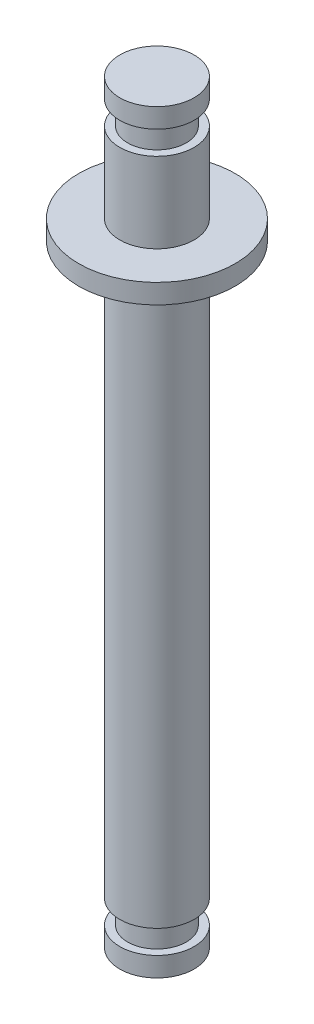
ISO-10303-21;
HEADER;
FILE_DESCRIPTION(('STEP AP214'),'2;1');
FILE_NAME('part.step','',(''),(''),'','','');
FILE_SCHEMA(('AUTOMOTIVE_DESIGN { 1 0 10303 214 1 1 1 1 }'));
ENDSEC;
DATA;
#1=APPLICATION_CONTEXT('core data for automotive mechanical design processes');
#2=APPLICATION_PROTOCOL_DEFINITION('international standard','automotive_design',2000,#1);
#3=PRODUCT_CONTEXT('',#1,'mechanical');
#4=PRODUCT('Part','Part','',(#3));
#5=PRODUCT_RELATED_PRODUCT_CATEGORY('part','',(#4));
#6=PRODUCT_DEFINITION_FORMATION('','',#4);
#7=PRODUCT_DEFINITION_CONTEXT('part definition',#1,'design');
#8=PRODUCT_DEFINITION('design','',#6,#7);
#9=PRODUCT_DEFINITION_SHAPE('','',#8);
#10=(LENGTH_UNIT() NAMED_UNIT(*) SI_UNIT(.MILLI.,.METRE.));
#11=(NAMED_UNIT(*) PLANE_ANGLE_UNIT() SI_UNIT($,.RADIAN.));
#12=(NAMED_UNIT(*) SI_UNIT($,.STERADIAN.) SOLID_ANGLE_UNIT());
#13=UNCERTAINTY_MEASURE_WITH_UNIT(LENGTH_MEASURE(1.E-05),#10,'distance_accuracy_value','');
#14=(GEOMETRIC_REPRESENTATION_CONTEXT(3) GLOBAL_UNCERTAINTY_ASSIGNED_CONTEXT((#13)) GLOBAL_UNIT_ASSIGNED_CONTEXT((#10,
#11,#12)) REPRESENTATION_CONTEXT('',''));
#15=CARTESIAN_POINT('',(0.,0.,0.));
#16=DIRECTION('',(0.,0.,1.));
#17=DIRECTION('',(1.,0.,0.));
#18=AXIS2_PLACEMENT_3D('',#15,#16,#17);
#19=CARTESIAN_POINT('',(0.,7.3,0.));
#20=DIRECTION('',(0.,-1.,0.));
#21=DIRECTION('',(0.,0.,-1.));
#22=AXIS2_PLACEMENT_3D('',#19,#20,#21);
#23=PLANE('',#22);
#24=CARTESIAN_POINT('',(0.,7.3,0.));
#25=DIRECTION('',(0.,1.,0.));
#26=DIRECTION('',(0.,0.,1.));
#27=AXIS2_PLACEMENT_3D('',#24,#25,#26);
#28=CIRCLE('',#27,1.9);
#29=CARTESIAN_POINT('',(0.,7.3,1.9));
#30=VERTEX_POINT('',#29);
#31=EDGE_CURVE('E10',#30,#30,#28,.T.);
#32=ORIENTED_EDGE('',*,*,#31,.T.);
#33=EDGE_LOOP('',(#32));
#34=FACE_BOUND('',#33,.T.);
#35=ADVANCED_FACE('F15',(#34),#23,.F.);
#36=CARTESIAN_POINT('',(0.,27.3318394450156,0.));
#37=DIRECTION('',(0.,1.,0.));
#38=DIRECTION('',(0.,0.,1.));
#39=AXIS2_PLACEMENT_3D('',#36,#37,#38);
#40=CYLINDRICAL_SURFACE('',#39,1.9);
#41=ORIENTED_EDGE('',*,*,#31,.F.);
#42=EDGE_LOOP('',(#41));
#43=FACE_BOUND('',#42,.T.);
#44=CARTESIAN_POINT('',(0.,6.3,0.));
#45=DIRECTION('',(0.,1.,0.));
#46=DIRECTION('',(0.,0.,1.));
#47=AXIS2_PLACEMENT_3D('',#44,#45,#46);
#48=CIRCLE('',#47,1.9);
#49=CARTESIAN_POINT('',(0.,6.3,1.9));
#50=VERTEX_POINT('',#49);
#51=EDGE_CURVE('E21',#50,#50,#48,.T.);
#52=ORIENTED_EDGE('',*,*,#51,.T.);
#53=EDGE_LOOP('',(#52));
#54=FACE_BOUND('',#53,.T.);
#55=ADVANCED_FACE('F78',(#43,#54),#40,.T.);
#56=CARTESIAN_POINT('',(0.,6.3,-1.9));
#57=DIRECTION('',(0.,1.,0.));
#58=DIRECTION('',(0.,0.,1.));
#59=AXIS2_PLACEMENT_3D('',#56,#57,#58);
#60=PLANE('',#59);
#61=ORIENTED_EDGE('',*,*,#51,.F.);
#62=EDGE_LOOP('',(#61));
#63=FACE_BOUND('',#62,.T.);
#64=CARTESIAN_POINT('',(0.,6.3,0.));
#65=DIRECTION('',(0.,1.,0.));
#66=DIRECTION('',(0.,0.,1.));
#67=AXIS2_PLACEMENT_3D('',#64,#65,#66);
#68=CIRCLE('',#67,1.5);
#69=CARTESIAN_POINT('',(0.,6.3,1.5));
#70=VERTEX_POINT('',#69);
#71=EDGE_CURVE('E25',#70,#70,#68,.T.);
#72=ORIENTED_EDGE('',*,*,#71,.T.);
#73=EDGE_LOOP('',(#72));
#74=FACE_BOUND('',#73,.T.);
#75=ADVANCED_FACE('F82',(#63,#74),#60,.F.);
#76=CARTESIAN_POINT('',(0.,27.3318394450156,0.));
#77=DIRECTION('',(0.,1.,0.));
#78=DIRECTION('',(0.,0.,1.));
#79=AXIS2_PLACEMENT_3D('',#76,#77,#78);
#80=CYLINDRICAL_SURFACE('',#79,1.5);
#81=ORIENTED_EDGE('',*,*,#71,.F.);
#82=EDGE_LOOP('',(#81));
#83=FACE_BOUND('',#82,.T.);
#84=CARTESIAN_POINT('',(0.,5.1,0.));
#85=DIRECTION('',(0.,1.,0.));
#86=DIRECTION('',(0.,0.,1.));
#87=AXIS2_PLACEMENT_3D('',#84,#85,#86);
#88=CIRCLE('',#87,1.5);
#89=CARTESIAN_POINT('',(0.,5.1,1.5));
#90=VERTEX_POINT('',#89);
#91=EDGE_CURVE('E29',#90,#90,#88,.T.);
#92=ORIENTED_EDGE('',*,*,#91,.T.);
#93=EDGE_LOOP('',(#92));
#94=FACE_BOUND('',#93,.T.);
#95=ADVANCED_FACE('F87',(#83,#94),#80,.T.);
#96=CARTESIAN_POINT('',(0.,5.1,-1.5));
#97=DIRECTION('',(0.,-1.,0.));
#98=DIRECTION('',(0.,0.,-1.));
#99=AXIS2_PLACEMENT_3D('',#96,#97,#98);
#100=PLANE('',#99);
#101=ORIENTED_EDGE('',*,*,#91,.F.);
#102=EDGE_LOOP('',(#101));
#103=FACE_BOUND('',#102,.T.);
#104=CARTESIAN_POINT('',(0.,5.1,0.));
#105=DIRECTION('',(0.,1.,0.));
#106=DIRECTION('',(0.,0.,1.));
#107=AXIS2_PLACEMENT_3D('',#104,#105,#106);
#108=CIRCLE('',#107,1.9);
#109=CARTESIAN_POINT('',(0.,5.1,1.9));
#110=VERTEX_POINT('',#109);
#111=EDGE_CURVE('E34',#110,#110,#108,.T.);
#112=ORIENTED_EDGE('',*,*,#111,.T.);
#113=EDGE_LOOP('',(#112));
#114=FACE_BOUND('',#113,.T.);
#115=ADVANCED_FACE('F93',(#103,#114),#100,.F.);
#116=CARTESIAN_POINT('',(0.,27.3318394450156,0.));
#117=DIRECTION('',(0.,1.,0.));
#118=DIRECTION('',(0.,0.,1.));
#119=AXIS2_PLACEMENT_3D('',#116,#117,#118);
#120=CYLINDRICAL_SURFACE('',#119,1.9);
#121=ORIENTED_EDGE('',*,*,#111,.F.);
#122=EDGE_LOOP('',(#121));
#123=FACE_BOUND('',#122,.T.);
#124=CARTESIAN_POINT('',(0.,1.,0.));
#125=DIRECTION('',(0.,1.,0.));
#126=DIRECTION('',(0.,0.,1.));
#127=AXIS2_PLACEMENT_3D('',#124,#125,#126);
#128=CIRCLE('',#127,1.9);
#129=CARTESIAN_POINT('',(0.,1.,1.9));
#130=VERTEX_POINT('',#129);
#131=EDGE_CURVE('E37',#130,#130,#128,.T.);
#132=ORIENTED_EDGE('',*,*,#131,.T.);
#133=EDGE_LOOP('',(#132));
#134=FACE_BOUND('',#133,.T.);
#135=ADVANCED_FACE('F97',(#123,#134),#120,.T.);
#136=CARTESIAN_POINT('',(0.,1.,-1.9));
#137=DIRECTION('',(0.,-1.,0.));
#138=DIRECTION('',(0.,0.,-1.));
#139=AXIS2_PLACEMENT_3D('',#136,#137,#138);
#140=PLANE('',#139);
#141=ORIENTED_EDGE('',*,*,#131,.F.);
#142=EDGE_LOOP('',(#141));
#143=FACE_BOUND('',#142,.T.);
#144=CARTESIAN_POINT('',(0.,1.,0.));
#145=DIRECTION('',(0.,1.,0.));
#146=DIRECTION('',(0.,0.,1.));
#147=AXIS2_PLACEMENT_3D('',#144,#145,#146);
#148=CIRCLE('',#147,4.);
#149=CARTESIAN_POINT('',(0.,1.,4.));
#150=VERTEX_POINT('',#149);
#151=EDGE_CURVE('E40',#150,#150,#148,.T.);
#152=ORIENTED_EDGE('',*,*,#151,.T.);
#153=EDGE_LOOP('',(#152));
#154=FACE_BOUND('',#153,.T.);
#155=ADVANCED_FACE('F101',(#143,#154),#140,.F.);
#156=CARTESIAN_POINT('',(0.,27.3318394450156,0.));
#157=DIRECTION('',(0.,1.,0.));
#158=DIRECTION('',(0.,0.,1.));
#159=AXIS2_PLACEMENT_3D('',#156,#157,#158);
#160=CYLINDRICAL_SURFACE('',#159,4.);
#161=ORIENTED_EDGE('',*,*,#151,.F.);
#162=EDGE_LOOP('',(#161));
#163=FACE_BOUND('',#162,.T.);
#164=CARTESIAN_POINT('',(0.,0.,0.));
#165=DIRECTION('',(0.,1.,0.));
#166=DIRECTION('',(0.,0.,1.));
#167=AXIS2_PLACEMENT_3D('',#164,#165,#166);
#168=CIRCLE('',#167,4.);
#169=CARTESIAN_POINT('',(0.,0.,4.));
#170=VERTEX_POINT('',#169);
#171=EDGE_CURVE('E43',#170,#170,#168,.T.);
#172=ORIENTED_EDGE('',*,*,#171,.T.);
#173=EDGE_LOOP('',(#172));
#174=FACE_BOUND('',#173,.T.);
#175=ADVANCED_FACE('F105',(#163,#174),#160,.T.);
#176=CARTESIAN_POINT('',(0.,0.,-4.));
#177=DIRECTION('',(0.,1.,0.));
#178=DIRECTION('',(0.,0.,1.));
#179=AXIS2_PLACEMENT_3D('',#176,#177,#178);
#180=PLANE('',#179);
#181=ORIENTED_EDGE('',*,*,#171,.F.);
#182=EDGE_LOOP('',(#181));
#183=FACE_BOUND('',#182,.T.);
#184=CARTESIAN_POINT('',(0.,0.,0.));
#185=DIRECTION('',(0.,1.,0.));
#186=DIRECTION('',(0.,0.,1.));
#187=AXIS2_PLACEMENT_3D('',#184,#185,#186);
#188=CIRCLE('',#187,1.9);
#189=CARTESIAN_POINT('',(0.,0.,1.9));
#190=VERTEX_POINT('',#189);
#191=EDGE_CURVE('E46',#190,#190,#188,.T.);
#192=ORIENTED_EDGE('',*,*,#191,.T.);
#193=EDGE_LOOP('',(#192));
#194=FACE_BOUND('',#193,.T.);
#195=ADVANCED_FACE('F109',(#183,#194),#180,.F.);
#196=CARTESIAN_POINT('',(0.,27.3318394450156,0.));
#197=DIRECTION('',(0.,1.,0.));
#198=DIRECTION('',(0.,0.,1.));
#199=AXIS2_PLACEMENT_3D('',#196,#197,#198);
#200=CYLINDRICAL_SURFACE('',#199,1.9);
#201=ORIENTED_EDGE('',*,*,#191,.F.);
#202=EDGE_LOOP('',(#201));
#203=FACE_BOUND('',#202,.T.);
#204=CARTESIAN_POINT('',(0.,-29.1,0.));
#205=DIRECTION('',(0.,1.,0.));
#206=DIRECTION('',(0.,0.,1.));
#207=AXIS2_PLACEMENT_3D('',#204,#205,#206);
#208=CIRCLE('',#207,1.9);
#209=CARTESIAN_POINT('',(0.,-29.1,1.9));
#210=VERTEX_POINT('',#209);
#211=EDGE_CURVE('E49',#210,#210,#208,.T.);
#212=ORIENTED_EDGE('',*,*,#211,.T.);
#213=EDGE_LOOP('',(#212));
#214=FACE_BOUND('',#213,.T.);
#215=ADVANCED_FACE('F113',(#203,#214),#200,.T.);
#216=CARTESIAN_POINT('',(0.,-29.1,-1.9));
#217=DIRECTION('',(0.,1.,0.));
#218=DIRECTION('',(0.,0.,1.));
#219=AXIS2_PLACEMENT_3D('',#216,#217,#218);
#220=PLANE('',#219);
#221=ORIENTED_EDGE('',*,*,#211,.F.);
#222=EDGE_LOOP('',(#221));
#223=FACE_BOUND('',#222,.T.);
#224=CARTESIAN_POINT('',(0.,-29.1,0.));
#225=DIRECTION('',(0.,1.,0.));
#226=DIRECTION('',(0.,0.,1.));
#227=AXIS2_PLACEMENT_3D('',#224,#225,#226);
#228=CIRCLE('',#227,1.5);
#229=CARTESIAN_POINT('',(0.,-29.1,1.5));
#230=VERTEX_POINT('',#229);
#231=EDGE_CURVE('E52',#230,#230,#228,.T.);
#232=ORIENTED_EDGE('',*,*,#231,.T.);
#233=EDGE_LOOP('',(#232));
#234=FACE_BOUND('',#233,.T.);
#235=ADVANCED_FACE('F117',(#223,#234),#220,.F.);
#236=CARTESIAN_POINT('',(0.,27.3318394450156,0.));
#237=DIRECTION('',(0.,1.,0.));
#238=DIRECTION('',(0.,0.,1.));
#239=AXIS2_PLACEMENT_3D('',#236,#237,#238);
#240=CYLINDRICAL_SURFACE('',#239,1.5);
#241=ORIENTED_EDGE('',*,*,#231,.F.);
#242=EDGE_LOOP('',(#241));
#243=FACE_BOUND('',#242,.T.);
#244=CARTESIAN_POINT('',(0.,-30.3,0.));
#245=DIRECTION('',(0.,1.,0.));
#246=DIRECTION('',(0.,0.,1.));
#247=AXIS2_PLACEMENT_3D('',#244,#245,#246);
#248=CIRCLE('',#247,1.5);
#249=CARTESIAN_POINT('',(0.,-30.3,1.5));
#250=VERTEX_POINT('',#249);
#251=EDGE_CURVE('E55',#250,#250,#248,.T.);
#252=ORIENTED_EDGE('',*,*,#251,.T.);
#253=EDGE_LOOP('',(#252));
#254=FACE_BOUND('',#253,.T.);
#255=ADVANCED_FACE('F121',(#243,#254),#240,.T.);
#256=CARTESIAN_POINT('',(0.,-30.3,-1.5));
#257=DIRECTION('',(0.,-1.,0.));
#258=DIRECTION('',(0.,0.,-1.));
#259=AXIS2_PLACEMENT_3D('',#256,#257,#258);
#260=PLANE('',#259);
#261=ORIENTED_EDGE('',*,*,#251,.F.);
#262=EDGE_LOOP('',(#261));
#263=FACE_BOUND('',#262,.T.);
#264=CARTESIAN_POINT('',(0.,-30.3,0.));
#265=DIRECTION('',(0.,1.,0.));
#266=DIRECTION('',(0.,0.,1.));
#267=AXIS2_PLACEMENT_3D('',#264,#265,#266);
#268=CIRCLE('',#267,1.9);
#269=CARTESIAN_POINT('',(0.,-30.3,1.9));
#270=VERTEX_POINT('',#269);
#271=EDGE_CURVE('E58',#270,#270,#268,.T.);
#272=ORIENTED_EDGE('',*,*,#271,.T.);
#273=EDGE_LOOP('',(#272));
#274=FACE_BOUND('',#273,.T.);
#275=ADVANCED_FACE('F74',(#263,#274),#260,.F.);
#276=CARTESIAN_POINT('',(0.,27.3318394450156,0.));
#277=DIRECTION('',(0.,1.,0.));
#278=DIRECTION('',(0.,0.,1.));
#279=AXIS2_PLACEMENT_3D('',#276,#277,#278);
#280=CYLINDRICAL_SURFACE('',#279,1.9);
#281=ORIENTED_EDGE('',*,*,#271,.F.);
#282=EDGE_LOOP('',(#281));
#283=FACE_BOUND('',#282,.T.);
#284=CARTESIAN_POINT('',(0.,-31.3,0.));
#285=DIRECTION('',(0.,1.,0.));
#286=DIRECTION('',(0.,0.,1.));
#287=AXIS2_PLACEMENT_3D('',#284,#285,#286);
#288=CIRCLE('',#287,1.9);
#289=CARTESIAN_POINT('',(0.,-31.3,1.9));
#290=VERTEX_POINT('',#289);
#291=EDGE_CURVE('E61',#290,#290,#288,.T.);
#292=ORIENTED_EDGE('',*,*,#291,.T.);
#293=EDGE_LOOP('',(#292));
#294=FACE_BOUND('',#293,.T.);
#295=ADVANCED_FACE('F65',(#283,#294),#280,.T.);
#296=CARTESIAN_POINT('',(0.,-31.3,-1.9));
#297=DIRECTION('',(0.,1.,0.));
#298=DIRECTION('',(0.,0.,1.));
#299=AXIS2_PLACEMENT_3D('',#296,#297,#298);
#300=PLANE('',#299);
#301=ORIENTED_EDGE('',*,*,#291,.F.);
#302=EDGE_LOOP('',(#301));
#303=FACE_BOUND('',#302,.T.);
#304=ADVANCED_FACE('F67',(#303),#300,.F.);
#305=CLOSED_SHELL('',(#35,#55,#75,#95,#115,#135,#155,#175,#195,#215,#235,#255,#275,#295,#304));
#306=MANIFOLD_SOLID_BREP('B1',#305);
#307=ADVANCED_BREP_SHAPE_REPRESENTATION('',(#18,#306),#14);
#308=SHAPE_DEFINITION_REPRESENTATION(#9,#307);
ENDSEC;
END-ISO-10303-21;
